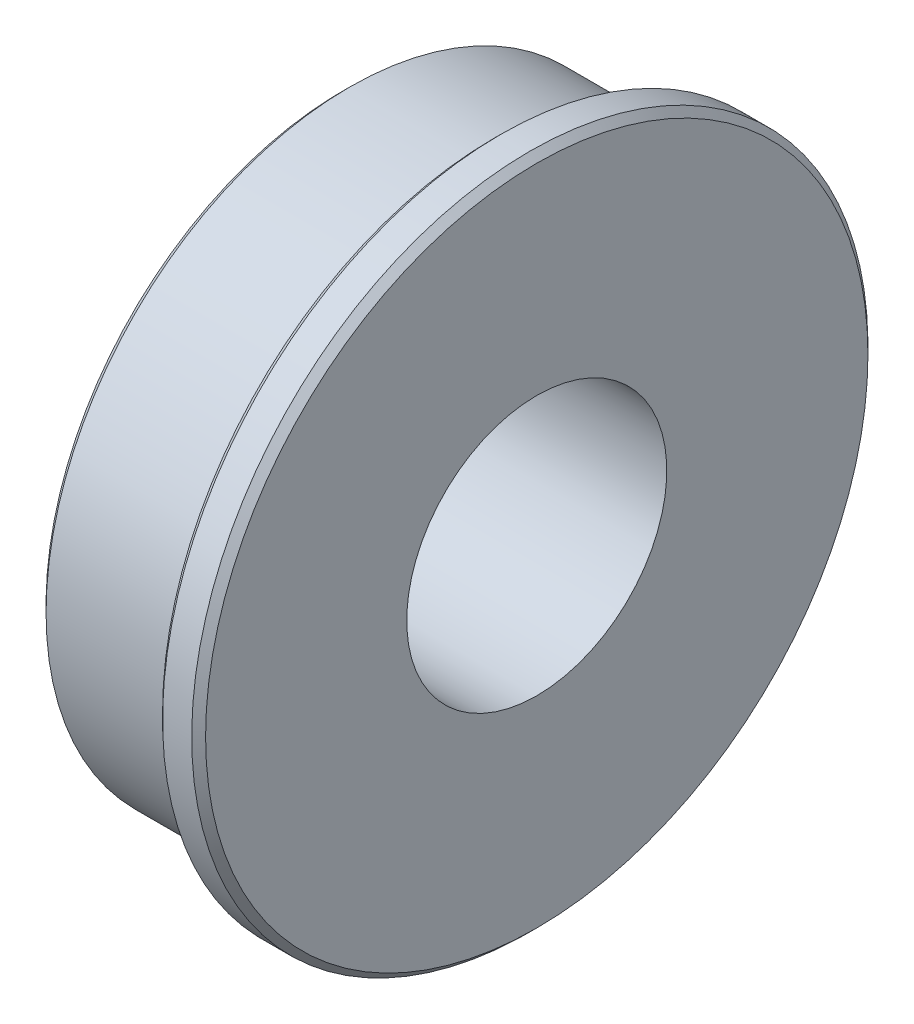
ISO-10303-21;
HEADER;
FILE_DESCRIPTION(('STEP AP214'),'2;1');
FILE_NAME('part.step','',(''),(''),'','','');
FILE_SCHEMA(('AUTOMOTIVE_DESIGN { 1 0 10303 214 1 1 1 1 }'));
ENDSEC;
DATA;
#1=APPLICATION_CONTEXT('core data for automotive mechanical design processes');
#2=APPLICATION_PROTOCOL_DEFINITION('international standard','automotive_design',2000,#1);
#3=PRODUCT_CONTEXT('',#1,'mechanical');
#4=PRODUCT('Part','Part','',(#3));
#5=PRODUCT_RELATED_PRODUCT_CATEGORY('part','',(#4));
#6=PRODUCT_DEFINITION_FORMATION('','',#4);
#7=PRODUCT_DEFINITION_CONTEXT('part definition',#1,'design');
#8=PRODUCT_DEFINITION('design','',#6,#7);
#9=PRODUCT_DEFINITION_SHAPE('','',#8);
#10=(LENGTH_UNIT() NAMED_UNIT(*) SI_UNIT(.MILLI.,.METRE.));
#11=(NAMED_UNIT(*) PLANE_ANGLE_UNIT() SI_UNIT($,.RADIAN.));
#12=(NAMED_UNIT(*) SI_UNIT($,.STERADIAN.) SOLID_ANGLE_UNIT());
#13=UNCERTAINTY_MEASURE_WITH_UNIT(LENGTH_MEASURE(1.E-05),#10,'distance_accuracy_value','');
#14=(GEOMETRIC_REPRESENTATION_CONTEXT(3) GLOBAL_UNCERTAINTY_ASSIGNED_CONTEXT((#13)) GLOBAL_UNIT_ASSIGNED_CONTEXT((#10,
#11,#12)) REPRESENTATION_CONTEXT('',''));
#15=CARTESIAN_POINT('',(0.,0.,0.));
#16=DIRECTION('',(0.,0.,1.));
#17=DIRECTION('',(1.,0.,0.));
#18=AXIS2_PLACEMENT_3D('',#15,#16,#17);
#19=CARTESIAN_POINT('',(-3.556,11.1125,0.));
#20=DIRECTION('',(-1.,0.,0.));
#21=DIRECTION('',(0.,-1.,0.));
#22=AXIS2_PLACEMENT_3D('',#19,#20,#21);
#23=PLANE('',#22);
#24=CARTESIAN_POINT('',(-3.556,0.,0.));
#25=DIRECTION('',(-1.,0.,0.));
#26=DIRECTION('',(0.,-1.,0.));
#27=AXIS2_PLACEMENT_3D('',#24,#25,#26);
#28=CIRCLE('',#27,10.8585);
#29=CARTESIAN_POINT('',(-3.55599999999999,-10.8585,0.));
#30=VERTEX_POINT('',#29);
#31=EDGE_CURVE('E10',#30,#30,#28,.T.);
#32=ORIENTED_EDGE('',*,*,#31,.T.);
#33=EDGE_LOOP('',(#32));
#34=FACE_BOUND('',#33,.T.);
#35=CARTESIAN_POINT('',(-3.556,0.,0.));
#36=DIRECTION('',(1.,0.,0.));
#37=DIRECTION('',(0.,1.,0.));
#38=AXIS2_PLACEMENT_3D('',#35,#36,#37);
#39=CIRCLE('',#38,4.7625);
#40=CARTESIAN_POINT('',(-3.556,4.7625,0.));
#41=VERTEX_POINT('',#40);
#42=EDGE_CURVE('E57',#41,#41,#39,.T.);
#43=ORIENTED_EDGE('',*,*,#42,.T.);
#44=EDGE_LOOP('',(#43));
#45=FACE_BOUND('',#44,.T.);
#46=ADVANCED_FACE('F31',(#34,#45),#23,.T.);
#47=CARTESIAN_POINT('',(3.556,0.,0.));
#48=DIRECTION('',(1.,0.,0.));
#49=DIRECTION('',(0.,1.,0.));
#50=AXIS2_PLACEMENT_3D('',#47,#48,#49);
#51=CYLINDRICAL_SURFACE('',#50,4.7625);
#52=CARTESIAN_POINT('',(3.556,0.,0.));
#53=DIRECTION('',(1.,0.,0.));
#54=DIRECTION('',(0.,1.,0.));
#55=AXIS2_PLACEMENT_3D('',#52,#53,#54);
#56=CIRCLE('',#55,4.7625);
#57=CARTESIAN_POINT('',(3.556,4.7625,0.));
#58=VERTEX_POINT('',#57);
#59=EDGE_CURVE('E60',#58,#58,#56,.T.);
#60=ORIENTED_EDGE('',*,*,#59,.T.);
#61=EDGE_LOOP('',(#60));
#62=FACE_BOUND('',#61,.T.);
#63=ORIENTED_EDGE('',*,*,#42,.F.);
#64=EDGE_LOOP('',(#63));
#65=FACE_BOUND('',#64,.T.);
#66=ADVANCED_FACE('F85',(#62,#65),#51,.F.);
#67=CARTESIAN_POINT('',(3.556,4.7625,0.));
#68=DIRECTION('',(1.,0.,0.));
#69=DIRECTION('',(0.,1.,0.));
#70=AXIS2_PLACEMENT_3D('',#67,#68,#69);
#71=PLANE('',#70);
#72=CARTESIAN_POINT('',(3.556,0.,0.));
#73=DIRECTION('',(1.,0.,0.));
#74=DIRECTION('',(0.,1.,0.));
#75=AXIS2_PLACEMENT_3D('',#72,#73,#74);
#76=CIRCLE('',#75,12.1285);
#77=CARTESIAN_POINT('',(3.556,12.1285,0.));
#78=VERTEX_POINT('',#77);
#79=EDGE_CURVE('E42',#78,#78,#76,.T.);
#80=ORIENTED_EDGE('',*,*,#79,.T.);
#81=EDGE_LOOP('',(#80));
#82=FACE_BOUND('',#81,.T.);
#83=ORIENTED_EDGE('',*,*,#59,.F.);
#84=EDGE_LOOP('',(#83));
#85=FACE_BOUND('',#84,.T.);
#86=ADVANCED_FACE('F92',(#82,#85),#71,.T.);
#87=CARTESIAN_POINT('',(3.556,0.,0.));
#88=DIRECTION('',(1.,0.,0.));
#89=DIRECTION('',(0.,1.,0.));
#90=AXIS2_PLACEMENT_3D('',#87,#88,#89);
#91=CYLINDRICAL_SURFACE('',#90,12.3825);
#92=CARTESIAN_POINT('',(2.2352,0.,0.));
#93=DIRECTION('',(-1.,0.,0.));
#94=DIRECTION('',(0.,-1.,0.));
#95=AXIS2_PLACEMENT_3D('',#92,#93,#94);
#96=CIRCLE('',#95,12.3825);
#97=CARTESIAN_POINT('',(2.23520000000001,-12.3825,0.));
#98=VERTEX_POINT('',#97);
#99=EDGE_CURVE('E51',#98,#98,#96,.F.);
#100=ORIENTED_EDGE('',*,*,#99,.T.);
#101=EDGE_LOOP('',(#100));
#102=FACE_BOUND('',#101,.T.);
#103=CARTESIAN_POINT('',(3.30200000000001,0.,0.));
#104=DIRECTION('',(1.,0.,0.));
#105=DIRECTION('',(0.,1.,0.));
#106=AXIS2_PLACEMENT_3D('',#103,#104,#105);
#107=CIRCLE('',#106,12.3825);
#108=CARTESIAN_POINT('',(3.302,12.3825,0.));
#109=VERTEX_POINT('',#108);
#110=EDGE_CURVE('E54',#109,#109,#107,.F.);
#111=ORIENTED_EDGE('',*,*,#110,.T.);
#112=EDGE_LOOP('',(#111));
#113=FACE_BOUND('',#112,.T.);
#114=ADVANCED_FACE('F81',(#102,#113),#91,.T.);
#115=CARTESIAN_POINT('',(1.9812,11.1125,0.));
#116=DIRECTION('',(-1.,0.,0.));
#117=DIRECTION('',(0.,-1.,0.));
#118=AXIS2_PLACEMENT_3D('',#115,#116,#117);
#119=PLANE('',#118);
#120=CARTESIAN_POINT('',(1.9812,0.,0.));
#121=DIRECTION('',(-1.,0.,0.));
#122=DIRECTION('',(0.,-1.,0.));
#123=AXIS2_PLACEMENT_3D('',#120,#121,#122);
#124=CIRCLE('',#123,12.1285);
#125=CARTESIAN_POINT('',(1.98120000000001,-12.1285,0.));
#126=VERTEX_POINT('',#125);
#127=EDGE_CURVE('E46',#126,#126,#124,.T.);
#128=ORIENTED_EDGE('',*,*,#127,.T.);
#129=EDGE_LOOP('',(#128));
#130=FACE_BOUND('',#129,.T.);
#131=CARTESIAN_POINT('',(1.9812,0.,0.));
#132=DIRECTION('',(1.,0.,0.));
#133=DIRECTION('',(0.,1.,0.));
#134=AXIS2_PLACEMENT_3D('',#131,#132,#133);
#135=CIRCLE('',#134,11.1125);
#136=CARTESIAN_POINT('',(1.9812,11.1125,0.));
#137=VERTEX_POINT('',#136);
#138=EDGE_CURVE('E63',#137,#137,#135,.T.);
#139=ORIENTED_EDGE('',*,*,#138,.T.);
#140=EDGE_LOOP('',(#139));
#141=FACE_BOUND('',#140,.T.);
#142=ADVANCED_FACE('F67',(#130,#141),#119,.T.);
#143=CARTESIAN_POINT('',(3.556,0.,0.));
#144=DIRECTION('',(1.,0.,0.));
#145=DIRECTION('',(0.,1.,0.));
#146=AXIS2_PLACEMENT_3D('',#143,#144,#145);
#147=CYLINDRICAL_SURFACE('',#146,11.1125);
#148=CARTESIAN_POINT('',(-3.302,0.,0.));
#149=DIRECTION('',(-1.,0.,0.));
#150=DIRECTION('',(0.,-1.,0.));
#151=AXIS2_PLACEMENT_3D('',#148,#149,#150);
#152=CIRCLE('',#151,11.1125);
#153=CARTESIAN_POINT('',(-3.30199999999999,-11.1125,0.));
#154=VERTEX_POINT('',#153);
#155=EDGE_CURVE('E38',#154,#154,#152,.F.);
#156=ORIENTED_EDGE('',*,*,#155,.T.);
#157=EDGE_LOOP('',(#156));
#158=FACE_BOUND('',#157,.T.);
#159=ORIENTED_EDGE('',*,*,#138,.F.);
#160=EDGE_LOOP('',(#159));
#161=FACE_BOUND('',#160,.T.);
#162=ADVANCED_FACE('F69',(#158,#161),#147,.T.);
#163=CARTESIAN_POINT('',(2.2352,0.,0.));
#164=DIRECTION('',(1.,0.,0.));
#165=DIRECTION('',(0.,1.,0.));
#166=AXIS2_PLACEMENT_3D('',#163,#164,#165);
#167=CONICAL_SURFACE('',#166,12.3825,0.785398163397453);
#168=ORIENTED_EDGE('',*,*,#127,.F.);
#169=EDGE_LOOP('',(#168));
#170=FACE_BOUND('',#169,.T.);
#171=ORIENTED_EDGE('',*,*,#99,.F.);
#172=EDGE_LOOP('',(#171));
#173=FACE_BOUND('',#172,.T.);
#174=ADVANCED_FACE('F71',(#170,#173),#167,.T.);
#175=CARTESIAN_POINT('',(3.556,0.,0.));
#176=DIRECTION('',(-1.,0.,0.));
#177=DIRECTION('',(0.,-1.,0.));
#178=AXIS2_PLACEMENT_3D('',#175,#176,#177);
#179=CONICAL_SURFACE('',#178,12.1285,0.785398163397448);
#180=ORIENTED_EDGE('',*,*,#110,.F.);
#181=EDGE_LOOP('',(#180));
#182=FACE_BOUND('',#181,.T.);
#183=ORIENTED_EDGE('',*,*,#79,.F.);
#184=EDGE_LOOP('',(#183));
#185=FACE_BOUND('',#184,.T.);
#186=ADVANCED_FACE('F78',(#182,#185),#179,.T.);
#187=CARTESIAN_POINT('',(-3.302,0.,0.));
#188=DIRECTION('',(1.,0.,0.));
#189=DIRECTION('',(0.,1.,0.));
#190=AXIS2_PLACEMENT_3D('',#187,#188,#189);
#191=CONICAL_SURFACE('',#190,11.1125,0.785398163397452);
#192=ORIENTED_EDGE('',*,*,#31,.F.);
#193=EDGE_LOOP('',(#192));
#194=FACE_BOUND('',#193,.T.);
#195=ORIENTED_EDGE('',*,*,#155,.F.);
#196=EDGE_LOOP('',(#195));
#197=FACE_BOUND('',#196,.T.);
#198=ADVANCED_FACE('F33',(#194,#197),#191,.T.);
#199=CLOSED_SHELL('',(#46,#66,#86,#114,#142,#162,#174,#186,#198));
#200=MANIFOLD_SOLID_BREP('B2',#199);
#201=ADVANCED_BREP_SHAPE_REPRESENTATION('',(#18,#200),#14);
#202=SHAPE_DEFINITION_REPRESENTATION(#9,#201);
ENDSEC;
END-ISO-10303-21;
